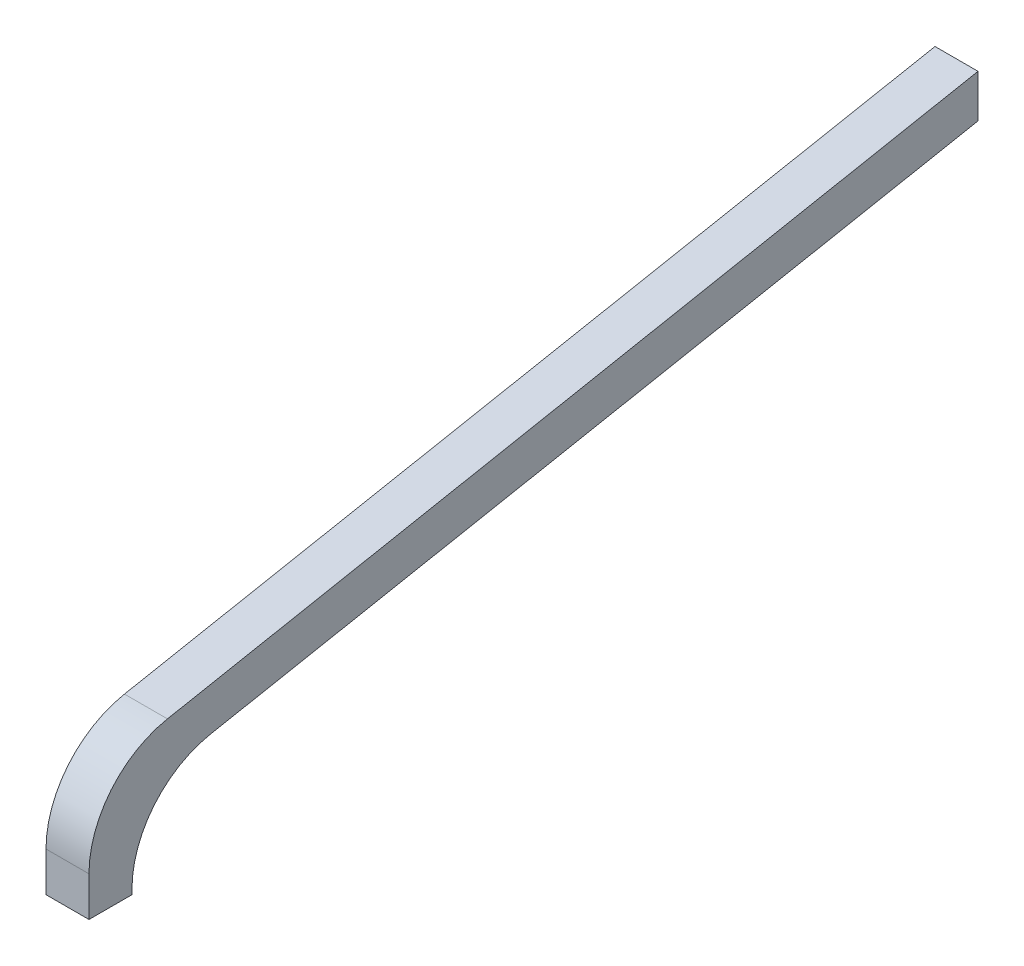
ISO-10303-21;
HEADER;
FILE_DESCRIPTION(('STEP AP214'),'2;1');
FILE_NAME('part.step','',(''),(''),'','','');
FILE_SCHEMA(('AUTOMOTIVE_DESIGN { 1 0 10303 214 1 1 1 1 }'));
ENDSEC;
DATA;
#1=APPLICATION_CONTEXT('core data for automotive mechanical design processes');
#2=APPLICATION_PROTOCOL_DEFINITION('international standard','automotive_design',2000,#1);
#3=PRODUCT_CONTEXT('',#1,'mechanical');
#4=PRODUCT('Part','Part','',(#3));
#5=PRODUCT_RELATED_PRODUCT_CATEGORY('part','',(#4));
#6=PRODUCT_DEFINITION_FORMATION('','',#4);
#7=PRODUCT_DEFINITION_CONTEXT('part definition',#1,'design');
#8=PRODUCT_DEFINITION('design','',#6,#7);
#9=PRODUCT_DEFINITION_SHAPE('','',#8);
#10=(LENGTH_UNIT() NAMED_UNIT(*) SI_UNIT(.MILLI.,.METRE.));
#11=(NAMED_UNIT(*) PLANE_ANGLE_UNIT() SI_UNIT($,.RADIAN.));
#12=(NAMED_UNIT(*) SI_UNIT($,.STERADIAN.) SOLID_ANGLE_UNIT());
#13=UNCERTAINTY_MEASURE_WITH_UNIT(LENGTH_MEASURE(1.E-05),#10,'distance_accuracy_value','');
#14=(GEOMETRIC_REPRESENTATION_CONTEXT(3) GLOBAL_UNCERTAINTY_ASSIGNED_CONTEXT((#13)) GLOBAL_UNIT_ASSIGNED_CONTEXT((#10,
#11,#12)) REPRESENTATION_CONTEXT('',''));
#15=CARTESIAN_POINT('',(0.,0.,0.));
#16=DIRECTION('',(0.,0.,1.));
#17=DIRECTION('',(1.,0.,0.));
#18=AXIS2_PLACEMENT_3D('',#15,#16,#17);
#19=CARTESIAN_POINT('',(2.31775,-3.01580115473571,-2.8055));
#20=DIRECTION('',(1.,0.,0.));
#21=DIRECTION('',(0.,0.,-1.));
#22=AXIS2_PLACEMENT_3D('',#19,#20,#21);
#23=PLANE('',#22);
#24=DIRECTION('',(0.,-0.18846469104419,0.982079966311104));
#25=VECTOR('',#24,1.);
#26=CARTESIAN_POINT('',(2.31775,-2.3929200336889,-3.06153530895581));
#27=LINE('',#26,#25);
#28=CARTESIAN_POINT('',(2.31775,-0.869500000000001,-11.));
#29=VERTEX_POINT('',#28);
#30=CARTESIAN_POINT('',(2.31775,-2.3929200336889,-3.06153530895581));
#31=VERTEX_POINT('',#30);
#32=EDGE_CURVE('E96',#29,#31,#27,.T.);
#33=ORIENTED_EDGE('',*,*,#32,.T.);
#34=CARTESIAN_POINT('',(2.31775,-3.375,-3.25));
#35=DIRECTION('',(-1.,0.,0.));
#36=DIRECTION('',(0.,0.,1.));
#37=AXIS2_PLACEMENT_3D('',#34,#35,#36);
#38=CIRCLE('',#37,1.);
#39=CARTESIAN_POINT('',(2.31775,-3.375,-2.25));
#40=VERTEX_POINT('',#39);
#41=EDGE_CURVE('E119',#31,#40,#38,.F.);
#42=ORIENTED_EDGE('',*,*,#41,.T.);
#43=DIRECTION('',(0.,1.,0.));
#44=VECTOR('',#43,1.);
#45=CARTESIAN_POINT('',(2.31775,-3.425,-2.25));
#46=LINE('',#45,#44);
#47=CARTESIAN_POINT('',(2.31775,-3.425,-2.25));
#48=VERTEX_POINT('',#47);
#49=EDGE_CURVE('E124',#40,#48,#46,.F.);
#50=ORIENTED_EDGE('',*,*,#49,.T.);
#51=DIRECTION('',(0.,0.,1.));
#52=VECTOR('',#51,1.);
#53=CARTESIAN_POINT('',(2.31775,-3.425,-1.8055));
#54=LINE('',#53,#52);
#55=CARTESIAN_POINT('',(2.31775,-3.425,-1.8055));
#56=VERTEX_POINT('',#55);
#57=EDGE_CURVE('E133',#48,#56,#54,.T.);
#58=ORIENTED_EDGE('',*,*,#57,.T.);
#59=DIRECTION('',(0.,1.,0.));
#60=VECTOR('',#59,1.);
#61=CARTESIAN_POINT('',(2.31775,-3.01580115473571,-1.8055));
#62=LINE('',#61,#60);
#63=CARTESIAN_POINT('',(2.31775,-3.01580115473571,-1.8055));
#64=VERTEX_POINT('',#63);
#65=EDGE_CURVE('E141',#56,#64,#62,.T.);
#66=ORIENTED_EDGE('',*,*,#65,.T.);
#67=CARTESIAN_POINT('',(2.31775,-3.01580115473571,-2.8055));
#68=DIRECTION('',(-1.,0.,0.));
#69=DIRECTION('',(0.,0.,1.));
#70=AXIS2_PLACEMENT_3D('',#67,#68,#69);
#71=CIRCLE('',#70,1.);
#72=CARTESIAN_POINT('',(2.31775,-2.03372118842461,-2.61703530895581));
#73=VERTEX_POINT('',#72);
#74=EDGE_CURVE('E20',#73,#64,#71,.F.);
#75=ORIENTED_EDGE('',*,*,#74,.F.);
#76=DIRECTION('',(0.,0.18846469104419,-0.982079966311104));
#77=VECTOR('',#76,1.);
#78=CARTESIAN_POINT('',(2.31775,-0.425000000000001,-11.));
#79=LINE('',#78,#77);
#80=CARTESIAN_POINT('',(2.31775,-0.425000000000001,-11.));
#81=VERTEX_POINT('',#80);
#82=EDGE_CURVE('E150',#73,#81,#79,.T.);
#83=ORIENTED_EDGE('',*,*,#82,.T.);
#84=DIRECTION('',(0.,1.,0.));
#85=VECTOR('',#84,1.);
#86=CARTESIAN_POINT('',(2.31775,-0.869500000000001,-11.));
#87=LINE('',#86,#85);
#88=EDGE_CURVE('E70',#81,#29,#87,.F.);
#89=ORIENTED_EDGE('',*,*,#88,.T.);
#90=EDGE_LOOP('',(#33,#42,#50,#58,#66,#75,#83,#89));
#91=FACE_BOUND('',#90,.T.);
#92=ADVANCED_FACE('F17',(#91),#23,.F.);
#93=CARTESIAN_POINT('',(2.76225,-0.869500000000001,-11.));
#94=DIRECTION('',(0.,0.,1.));
#95=DIRECTION('',(1.,0.,0.));
#96=AXIS2_PLACEMENT_3D('',#93,#94,#95);
#97=PLANE('',#96);
#98=DIRECTION('',(1.,0.,0.));
#99=VECTOR('',#98,1.);
#100=CARTESIAN_POINT('',(2.76225,-0.425000000000001,-11.));
#101=LINE('',#100,#99);
#102=CARTESIAN_POINT('',(2.76225,-0.425000000000001,-11.));
#103=VERTEX_POINT('',#102);
#104=EDGE_CURVE('E91',#81,#103,#101,.T.);
#105=ORIENTED_EDGE('',*,*,#104,.T.);
#106=DIRECTION('',(0.,1.,0.));
#107=VECTOR('',#106,1.);
#108=CARTESIAN_POINT('',(2.76225,-3.01580115473571,-11.));
#109=LINE('',#108,#107);
#110=CARTESIAN_POINT('',(2.76225,-0.869500000000001,-11.));
#111=VERTEX_POINT('',#110);
#112=EDGE_CURVE('E85',#111,#103,#109,.T.);
#113=ORIENTED_EDGE('',*,*,#112,.F.);
#114=DIRECTION('',(1.,0.,0.));
#115=VECTOR('',#114,1.);
#116=CARTESIAN_POINT('',(2.76225,-0.869500000000001,-11.));
#117=LINE('',#116,#115);
#118=EDGE_CURVE('E88',#111,#29,#117,.F.);
#119=ORIENTED_EDGE('',*,*,#118,.T.);
#120=ORIENTED_EDGE('',*,*,#88,.F.);
#121=EDGE_LOOP('',(#105,#113,#119,#120));
#122=FACE_BOUND('',#121,.T.);
#123=ADVANCED_FACE('F87',(#122),#97,.F.);
#124=CARTESIAN_POINT('',(2.76225,-0.425000000000001,-11.));
#125=DIRECTION('',(0.,-0.982079966311104,-0.18846469104419));
#126=DIRECTION('',(0.,0.18846469104419,-0.982079966311104));
#127=AXIS2_PLACEMENT_3D('',#124,#125,#126);
#128=PLANE('',#127);
#129=DIRECTION('',(-1.,0.,0.));
#130=VECTOR('',#129,1.);
#131=CARTESIAN_POINT('',(2.76225,-2.03372118842461,-2.61703530895581));
#132=LINE('',#131,#130);
#133=CARTESIAN_POINT('',(2.76225,-2.03372118842461,-2.61703530895581));
#134=VERTEX_POINT('',#133);
#135=EDGE_CURVE('E146',#134,#73,#132,.T.);
#136=ORIENTED_EDGE('',*,*,#135,.F.);
#137=DIRECTION('',(0.,-0.18846469104419,0.982079966311103));
#138=VECTOR('',#137,1.);
#139=CARTESIAN_POINT('',(2.76225,-0.425000000000001,-11.));
#140=LINE('',#139,#138);
#141=EDGE_CURVE('E95',#103,#134,#140,.T.);
#142=ORIENTED_EDGE('',*,*,#141,.F.);
#143=ORIENTED_EDGE('',*,*,#104,.F.);
#144=ORIENTED_EDGE('',*,*,#82,.F.);
#145=EDGE_LOOP('',(#136,#142,#143,#144));
#146=FACE_BOUND('',#145,.T.);
#147=ADVANCED_FACE('F190',(#146),#128,.F.);
#148=CARTESIAN_POINT('',(2.76225,-3.01580115473571,-2.8055));
#149=DIRECTION('',(-1.,0.,0.));
#150=DIRECTION('',(0.,0.,1.));
#151=AXIS2_PLACEMENT_3D('',#148,#149,#150);
#152=CYLINDRICAL_SURFACE('',#151,1.);
#153=CARTESIAN_POINT('',(2.76225,-3.01580115473571,-2.8055));
#154=DIRECTION('',(-1.,0.,0.));
#155=DIRECTION('',(0.,0.,1.));
#156=AXIS2_PLACEMENT_3D('',#153,#154,#155);
#157=CIRCLE('',#156,1.);
#158=CARTESIAN_POINT('',(2.76225,-3.01580115473571,-1.8055));
#159=VERTEX_POINT('',#158);
#160=EDGE_CURVE('E116',#134,#159,#157,.F.);
#161=ORIENTED_EDGE('',*,*,#160,.F.);
#162=ORIENTED_EDGE('',*,*,#135,.T.);
#163=ORIENTED_EDGE('',*,*,#74,.T.);
#164=DIRECTION('',(-1.,0.,0.));
#165=VECTOR('',#164,1.);
#166=CARTESIAN_POINT('',(2.76225,-3.01580115473571,-1.8055));
#167=LINE('',#166,#165);
#168=EDGE_CURVE('E144',#64,#159,#167,.F.);
#169=ORIENTED_EDGE('',*,*,#168,.T.);
#170=EDGE_LOOP('',(#161,#162,#163,#169));
#171=FACE_BOUND('',#170,.T.);
#172=ADVANCED_FACE('F169',(#171),#152,.T.);
#173=CARTESIAN_POINT('',(2.76225,-3.01580115473571,-1.8055));
#174=DIRECTION('',(0.,0.,-1.));
#175=DIRECTION('',(-1.,0.,0.));
#176=AXIS2_PLACEMENT_3D('',#173,#174,#175);
#177=PLANE('',#176);
#178=DIRECTION('',(1.,0.,0.));
#179=VECTOR('',#178,1.);
#180=CARTESIAN_POINT('',(2.76225,-3.425,-1.8055));
#181=LINE('',#180,#179);
#182=CARTESIAN_POINT('',(2.76225,-3.425,-1.8055));
#183=VERTEX_POINT('',#182);
#184=EDGE_CURVE('E139',#56,#183,#181,.T.);
#185=ORIENTED_EDGE('',*,*,#184,.T.);
#186=DIRECTION('',(0.,1.,0.));
#187=VECTOR('',#186,1.);
#188=CARTESIAN_POINT('',(2.76225,-3.01580115473571,-1.8055));
#189=LINE('',#188,#187);
#190=EDGE_CURVE('E118',#159,#183,#189,.F.);
#191=ORIENTED_EDGE('',*,*,#190,.F.);
#192=ORIENTED_EDGE('',*,*,#168,.F.);
#193=ORIENTED_EDGE('',*,*,#65,.F.);
#194=EDGE_LOOP('',(#185,#191,#192,#193));
#195=FACE_BOUND('',#194,.T.);
#196=ADVANCED_FACE('F174',(#195),#177,.F.);
#197=CARTESIAN_POINT('',(2.76225,-3.425,-1.8055));
#198=DIRECTION('',(0.,1.,0.));
#199=DIRECTION('',(0.,0.,1.));
#200=AXIS2_PLACEMENT_3D('',#197,#198,#199);
#201=PLANE('',#200);
#202=DIRECTION('',(1.,0.,0.));
#203=VECTOR('',#202,1.);
#204=CARTESIAN_POINT('',(2.76225,-3.425,-2.25));
#205=LINE('',#204,#203);
#206=CARTESIAN_POINT('',(2.76225,-3.425,-2.25));
#207=VERTEX_POINT('',#206);
#208=EDGE_CURVE('E127',#48,#207,#205,.T.);
#209=ORIENTED_EDGE('',*,*,#208,.T.);
#210=DIRECTION('',(0.,0.,-1.));
#211=VECTOR('',#210,1.);
#212=CARTESIAN_POINT('',(2.76225,-3.425,-2.8055));
#213=LINE('',#212,#211);
#214=EDGE_CURVE('E110',#183,#207,#213,.T.);
#215=ORIENTED_EDGE('',*,*,#214,.F.);
#216=ORIENTED_EDGE('',*,*,#184,.F.);
#217=ORIENTED_EDGE('',*,*,#57,.F.);
#218=EDGE_LOOP('',(#209,#215,#216,#217));
#219=FACE_BOUND('',#218,.T.);
#220=ADVANCED_FACE('F212',(#219),#201,.F.);
#221=CARTESIAN_POINT('',(2.76225,-3.425,-2.25));
#222=DIRECTION('',(0.,0.,1.));
#223=DIRECTION('',(1.,0.,0.));
#224=AXIS2_PLACEMENT_3D('',#221,#222,#223);
#225=PLANE('',#224);
#226=DIRECTION('',(-1.,0.,0.));
#227=VECTOR('',#226,1.);
#228=CARTESIAN_POINT('',(2.76225,-3.375,-2.25));
#229=LINE('',#228,#227);
#230=CARTESIAN_POINT('',(2.76225,-3.375,-2.25));
#231=VERTEX_POINT('',#230);
#232=EDGE_CURVE('E121',#40,#231,#229,.F.);
#233=ORIENTED_EDGE('',*,*,#232,.T.);
#234=DIRECTION('',(0.,1.,0.));
#235=VECTOR('',#234,1.);
#236=CARTESIAN_POINT('',(2.76225,-3.01580115473571,-2.25));
#237=LINE('',#236,#235);
#238=EDGE_CURVE('E107',#207,#231,#237,.T.);
#239=ORIENTED_EDGE('',*,*,#238,.F.);
#240=ORIENTED_EDGE('',*,*,#208,.F.);
#241=ORIENTED_EDGE('',*,*,#49,.F.);
#242=EDGE_LOOP('',(#233,#239,#240,#241));
#243=FACE_BOUND('',#242,.T.);
#244=ADVANCED_FACE('F209',(#243),#225,.F.);
#245=CARTESIAN_POINT('',(2.76225,-3.375,-3.25));
#246=DIRECTION('',(-1.,0.,0.));
#247=DIRECTION('',(0.,0.,1.));
#248=AXIS2_PLACEMENT_3D('',#245,#246,#247);
#249=CYLINDRICAL_SURFACE('',#248,1.);
#250=DIRECTION('',(1.,0.,0.));
#251=VECTOR('',#250,1.);
#252=CARTESIAN_POINT('',(2.76225,-2.3929200336889,-3.06153530895581));
#253=LINE('',#252,#251);
#254=CARTESIAN_POINT('',(2.76225,-2.3929200336889,-3.06153530895581));
#255=VERTEX_POINT('',#254);
#256=EDGE_CURVE('E35',#31,#255,#253,.T.);
#257=ORIENTED_EDGE('',*,*,#256,.T.);
#258=CARTESIAN_POINT('',(2.76225,-3.375,-3.25));
#259=DIRECTION('',(-1.,0.,0.));
#260=DIRECTION('',(0.,0.,1.));
#261=AXIS2_PLACEMENT_3D('',#258,#259,#260);
#262=CIRCLE('',#261,1.);
#263=EDGE_CURVE('E26',#231,#255,#262,.T.);
#264=ORIENTED_EDGE('',*,*,#263,.F.);
#265=ORIENTED_EDGE('',*,*,#232,.F.);
#266=ORIENTED_EDGE('',*,*,#41,.F.);
#267=EDGE_LOOP('',(#257,#264,#265,#266));
#268=FACE_BOUND('',#267,.T.);
#269=ADVANCED_FACE('F204',(#268),#249,.F.);
#270=CARTESIAN_POINT('',(2.76225,-2.3929200336889,-3.06153530895581));
#271=DIRECTION('',(0.,0.982079966311104,0.18846469104419));
#272=DIRECTION('',(0.,-0.18846469104419,0.982079966311104));
#273=AXIS2_PLACEMENT_3D('',#270,#271,#272);
#274=PLANE('',#273);
#275=ORIENTED_EDGE('',*,*,#118,.F.);
#276=DIRECTION('',(0.,0.18846469104419,-0.982079966311103));
#277=VECTOR('',#276,1.);
#278=CARTESIAN_POINT('',(2.76225,-2.3929200336889,-3.06153530895581));
#279=LINE('',#278,#277);
#280=EDGE_CURVE('E11',#255,#111,#279,.T.);
#281=ORIENTED_EDGE('',*,*,#280,.F.);
#282=ORIENTED_EDGE('',*,*,#256,.F.);
#283=ORIENTED_EDGE('',*,*,#32,.F.);
#284=EDGE_LOOP('',(#275,#281,#282,#283));
#285=FACE_BOUND('',#284,.T.);
#286=ADVANCED_FACE('F99',(#285),#274,.F.);
#287=CARTESIAN_POINT('',(2.76225,-3.01580115473571,-2.8055));
#288=DIRECTION('',(1.,0.,0.));
#289=DIRECTION('',(0.,0.,-1.));
#290=AXIS2_PLACEMENT_3D('',#287,#288,#289);
#291=PLANE('',#290);
#292=ORIENTED_EDGE('',*,*,#263,.T.);
#293=ORIENTED_EDGE('',*,*,#280,.T.);
#294=ORIENTED_EDGE('',*,*,#112,.T.);
#295=ORIENTED_EDGE('',*,*,#141,.T.);
#296=ORIENTED_EDGE('',*,*,#160,.T.);
#297=ORIENTED_EDGE('',*,*,#190,.T.);
#298=ORIENTED_EDGE('',*,*,#214,.T.);
#299=ORIENTED_EDGE('',*,*,#238,.T.);
#300=EDGE_LOOP('',(#292,#293,#294,#295,#296,#297,#298,#299));
#301=FACE_BOUND('',#300,.T.);
#302=ADVANCED_FACE('F103',(#301),#291,.T.);
#303=CLOSED_SHELL('',(#92,#123,#147,#172,#196,#220,#244,#269,#286,#302));
#304=MANIFOLD_SOLID_BREP('B1',#303);
#305=ADVANCED_BREP_SHAPE_REPRESENTATION('',(#18,#304),#14);
#306=SHAPE_DEFINITION_REPRESENTATION(#9,#305);
ENDSEC;
END-ISO-10303-21;
